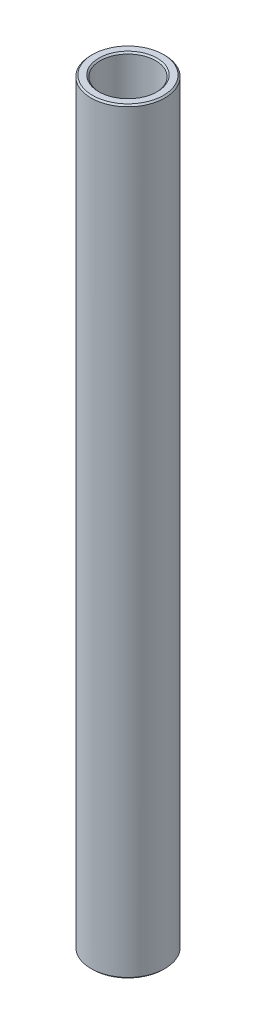
ISO-10303-21;
HEADER;
FILE_DESCRIPTION(('STEP AP214'),'2;1');
FILE_NAME('part.step','',(''),(''),'','','');
FILE_SCHEMA(('AUTOMOTIVE_DESIGN { 1 0 10303 214 1 1 1 1 }'));
ENDSEC;
DATA;
#1=APPLICATION_CONTEXT('core data for automotive mechanical design processes');
#2=APPLICATION_PROTOCOL_DEFINITION('international standard','automotive_design',2000,#1);
#3=PRODUCT_CONTEXT('',#1,'mechanical');
#4=PRODUCT('Part','Part','',(#3));
#5=PRODUCT_RELATED_PRODUCT_CATEGORY('part','',(#4));
#6=PRODUCT_DEFINITION_FORMATION('','',#4);
#7=PRODUCT_DEFINITION_CONTEXT('part definition',#1,'design');
#8=PRODUCT_DEFINITION('design','',#6,#7);
#9=PRODUCT_DEFINITION_SHAPE('','',#8);
#10=(LENGTH_UNIT() NAMED_UNIT(*) SI_UNIT(.MILLI.,.METRE.));
#11=(NAMED_UNIT(*) PLANE_ANGLE_UNIT() SI_UNIT($,.RADIAN.));
#12=(NAMED_UNIT(*) SI_UNIT($,.STERADIAN.) SOLID_ANGLE_UNIT());
#13=UNCERTAINTY_MEASURE_WITH_UNIT(LENGTH_MEASURE(1.E-05),#10,'distance_accuracy_value','');
#14=(GEOMETRIC_REPRESENTATION_CONTEXT(3) GLOBAL_UNCERTAINTY_ASSIGNED_CONTEXT((#13)) GLOBAL_UNIT_ASSIGNED_CONTEXT((#10,
#11,#12)) REPRESENTATION_CONTEXT('',''));
#15=CARTESIAN_POINT('',(0.,0.,0.));
#16=DIRECTION('',(0.,0.,1.));
#17=DIRECTION('',(1.,0.,0.));
#18=AXIS2_PLACEMENT_3D('',#15,#16,#17);
#19=CARTESIAN_POINT('',(0.,11.60859375,0.));
#20=DIRECTION('',(0.,1.,0.));
#21=DIRECTION('',(-1.,0.,0.));
#22=AXIS2_PLACEMENT_3D('',#19,#20,#21);
#23=CYLINDRICAL_SURFACE('',#22,4.76250000000001);
#24=CARTESIAN_POINT('',(0.,-64.8335,0.));
#25=DIRECTION('',(0.,1.,0.));
#26=DIRECTION('',(-1.,0.,0.));
#27=AXIS2_PLACEMENT_3D('',#24,#25,#26);
#28=CIRCLE('',#27,4.76250000000001);
#29=CARTESIAN_POINT('',(-4.76250000000002,-64.8335,0.));
#30=VERTEX_POINT('',#29);
#31=EDGE_CURVE('E51',#30,#30,#28,.F.);
#32=ORIENTED_EDGE('',*,*,#31,.T.);
#33=EDGE_LOOP('',(#32));
#34=FACE_BOUND('',#33,.T.);
#35=CARTESIAN_POINT('',(0.,64.8334999999999,0.));
#36=DIRECTION('',(0.,-1.,0.));
#37=DIRECTION('',(1.,0.,0.));
#38=AXIS2_PLACEMENT_3D('',#35,#36,#37);
#39=CIRCLE('',#38,4.76250000000001);
#40=CARTESIAN_POINT('',(4.76250000000002,64.8334999999999,0.));
#41=VERTEX_POINT('',#40);
#42=EDGE_CURVE('E54',#41,#41,#39,.F.);
#43=ORIENTED_EDGE('',*,*,#42,.T.);
#44=EDGE_LOOP('',(#43));
#45=FACE_BOUND('',#44,.T.);
#46=ADVANCED_FACE('F31',(#34,#45),#23,.F.);
#47=CARTESIAN_POINT('',(4.76250000000001,65.0875,0.));
#48=DIRECTION('',(0.,-1.,0.));
#49=DIRECTION('',(1.,0.,0.));
#50=AXIS2_PLACEMENT_3D('',#47,#48,#49);
#51=PLANE('',#50);
#52=CARTESIAN_POINT('',(0.,65.0875,0.));
#53=DIRECTION('',(0.,-1.,0.));
#54=DIRECTION('',(1.,0.,0.));
#55=AXIS2_PLACEMENT_3D('',#52,#53,#54);
#56=CIRCLE('',#55,6.09599999999997);
#57=CARTESIAN_POINT('',(6.09599999999998,65.0875,0.));
#58=VERTEX_POINT('',#57);
#59=EDGE_CURVE('E10',#58,#58,#56,.F.);
#60=ORIENTED_EDGE('',*,*,#59,.T.);
#61=EDGE_LOOP('',(#60));
#62=FACE_BOUND('',#61,.T.);
#63=CARTESIAN_POINT('',(0.,65.0875,0.));
#64=DIRECTION('',(0.,-1.,0.));
#65=DIRECTION('',(1.,0.,0.));
#66=AXIS2_PLACEMENT_3D('',#63,#64,#65);
#67=CIRCLE('',#66,5.01650000000006);
#68=CARTESIAN_POINT('',(5.01650000000007,65.0875,0.));
#69=VERTEX_POINT('',#68);
#70=EDGE_CURVE('E38',#69,#69,#67,.T.);
#71=ORIENTED_EDGE('',*,*,#70,.T.);
#72=EDGE_LOOP('',(#71));
#73=FACE_BOUND('',#72,.T.);
#74=ADVANCED_FACE('F77',(#62,#73),#51,.F.);
#75=CARTESIAN_POINT('',(0.,11.60859375,0.));
#76=DIRECTION('',(0.,1.,0.));
#77=DIRECTION('',(-1.,0.,0.));
#78=AXIS2_PLACEMENT_3D('',#75,#76,#77);
#79=CYLINDRICAL_SURFACE('',#78,6.35);
#80=CARTESIAN_POINT('',(0.,-64.8335,0.));
#81=DIRECTION('',(0.,1.,0.));
#82=DIRECTION('',(-1.,0.,0.));
#83=AXIS2_PLACEMENT_3D('',#80,#81,#82);
#84=CIRCLE('',#83,6.35);
#85=CARTESIAN_POINT('',(-6.35000000000001,-64.8335,0.));
#86=VERTEX_POINT('',#85);
#87=EDGE_CURVE('E42',#86,#86,#84,.T.);
#88=ORIENTED_EDGE('',*,*,#87,.T.);
#89=EDGE_LOOP('',(#88));
#90=FACE_BOUND('',#89,.T.);
#91=CARTESIAN_POINT('',(0.,64.8335,0.));
#92=DIRECTION('',(0.,-1.,0.));
#93=DIRECTION('',(1.,0.,0.));
#94=AXIS2_PLACEMENT_3D('',#91,#92,#93);
#95=CIRCLE('',#94,6.35);
#96=CARTESIAN_POINT('',(6.35000000000001,64.8335,0.));
#97=VERTEX_POINT('',#96);
#98=EDGE_CURVE('E46',#97,#97,#95,.T.);
#99=ORIENTED_EDGE('',*,*,#98,.T.);
#100=EDGE_LOOP('',(#99));
#101=FACE_BOUND('',#100,.T.);
#102=ADVANCED_FACE('F74',(#90,#101),#79,.T.);
#103=CARTESIAN_POINT('',(6.35000000000001,-65.0875,0.));
#104=DIRECTION('',(0.,1.,0.));
#105=DIRECTION('',(-1.,0.,0.));
#106=AXIS2_PLACEMENT_3D('',#103,#104,#105);
#107=PLANE('',#106);
#108=CARTESIAN_POINT('',(0.,-65.0875,0.));
#109=DIRECTION('',(0.,1.,0.));
#110=DIRECTION('',(-1.,0.,0.));
#111=AXIS2_PLACEMENT_3D('',#108,#109,#110);
#112=CIRCLE('',#111,5.01650000000001);
#113=CARTESIAN_POINT('',(-5.01650000000001,-65.0875,0.));
#114=VERTEX_POINT('',#113);
#115=EDGE_CURVE('E57',#114,#114,#112,.T.);
#116=ORIENTED_EDGE('',*,*,#115,.T.);
#117=EDGE_LOOP('',(#116));
#118=FACE_BOUND('',#117,.T.);
#119=CARTESIAN_POINT('',(0.,-65.0875,0.));
#120=DIRECTION('',(0.,1.,0.));
#121=DIRECTION('',(-1.,0.,0.));
#122=AXIS2_PLACEMENT_3D('',#119,#120,#121);
#123=CIRCLE('',#122,6.09600000000002);
#124=CARTESIAN_POINT('',(-6.09600000000002,-65.0875,0.));
#125=VERTEX_POINT('',#124);
#126=EDGE_CURVE('E60',#125,#125,#123,.F.);
#127=ORIENTED_EDGE('',*,*,#126,.T.);
#128=EDGE_LOOP('',(#127));
#129=FACE_BOUND('',#128,.T.);
#130=ADVANCED_FACE('F64',(#118,#129),#107,.F.);
#131=CARTESIAN_POINT('',(0.,-65.0875,0.));
#132=DIRECTION('',(0.,-1.,0.));
#133=DIRECTION('',(1.,0.,0.));
#134=AXIS2_PLACEMENT_3D('',#131,#132,#133);
#135=CONICAL_SURFACE('',#134,5.01650000000001,0.785398163397457);
#136=ORIENTED_EDGE('',*,*,#31,.F.);
#137=EDGE_LOOP('',(#136));
#138=FACE_BOUND('',#137,.T.);
#139=ORIENTED_EDGE('',*,*,#115,.F.);
#140=EDGE_LOOP('',(#139));
#141=FACE_BOUND('',#140,.T.);
#142=ADVANCED_FACE('F70',(#138,#141),#135,.F.);
#143=CARTESIAN_POINT('',(0.,-64.8335,0.));
#144=DIRECTION('',(0.,1.,0.));
#145=DIRECTION('',(-1.,0.,0.));
#146=AXIS2_PLACEMENT_3D('',#143,#144,#145);
#147=CONICAL_SURFACE('',#146,6.35,0.785398163397433);
#148=ORIENTED_EDGE('',*,*,#126,.F.);
#149=EDGE_LOOP('',(#148));
#150=FACE_BOUND('',#149,.T.);
#151=ORIENTED_EDGE('',*,*,#87,.F.);
#152=EDGE_LOOP('',(#151));
#153=FACE_BOUND('',#152,.T.);
#154=ADVANCED_FACE('F66',(#150,#153),#147,.T.);
#155=CARTESIAN_POINT('',(0.,65.0875,0.));
#156=DIRECTION('',(0.,-1.,0.));
#157=DIRECTION('',(1.,0.,0.));
#158=AXIS2_PLACEMENT_3D('',#155,#156,#157);
#159=CONICAL_SURFACE('',#158,6.09599999999998,0.78539816339746);
#160=ORIENTED_EDGE('',*,*,#98,.F.);
#161=EDGE_LOOP('',(#160));
#162=FACE_BOUND('',#161,.T.);
#163=ORIENTED_EDGE('',*,*,#59,.F.);
#164=EDGE_LOOP('',(#163));
#165=FACE_BOUND('',#164,.T.);
#166=ADVANCED_FACE('F69',(#162,#165),#159,.T.);
#167=CARTESIAN_POINT('',(0.,64.8334999999999,0.));
#168=DIRECTION('',(0.,1.,0.));
#169=DIRECTION('',(-1.,0.,0.));
#170=AXIS2_PLACEMENT_3D('',#167,#168,#169);
#171=CONICAL_SURFACE('',#170,4.76250000000001,0.78539816339743);
#172=ORIENTED_EDGE('',*,*,#70,.F.);
#173=EDGE_LOOP('',(#172));
#174=FACE_BOUND('',#173,.T.);
#175=ORIENTED_EDGE('',*,*,#42,.F.);
#176=EDGE_LOOP('',(#175));
#177=FACE_BOUND('',#176,.T.);
#178=ADVANCED_FACE('F33',(#174,#177),#171,.F.);
#179=CLOSED_SHELL('',(#46,#74,#102,#130,#142,#154,#166,#178));
#180=MANIFOLD_SOLID_BREP('B2',#179);
#181=ADVANCED_BREP_SHAPE_REPRESENTATION('',(#18,#180),#14);
#182=SHAPE_DEFINITION_REPRESENTATION(#9,#181);
ENDSEC;
END-ISO-10303-21;
